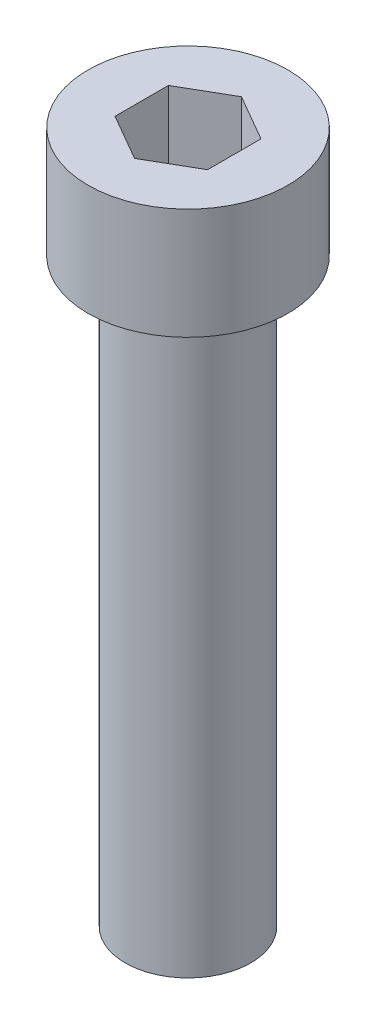
ISO-10303-21;
HEADER;
FILE_DESCRIPTION(('STEP AP214'),'2;1');
FILE_NAME('part.step','',(''),(''),'','','');
FILE_SCHEMA(('AUTOMOTIVE_DESIGN { 1 0 10303 214 1 1 1 1 }'));
ENDSEC;
DATA;
#1=APPLICATION_CONTEXT('core data for automotive mechanical design processes');
#2=APPLICATION_PROTOCOL_DEFINITION('international standard','automotive_design',2000,#1);
#3=PRODUCT_CONTEXT('',#1,'mechanical');
#4=PRODUCT('Part','Part','',(#3));
#5=PRODUCT_RELATED_PRODUCT_CATEGORY('part','',(#4));
#6=PRODUCT_DEFINITION_FORMATION('','',#4);
#7=PRODUCT_DEFINITION_CONTEXT('part definition',#1,'design');
#8=PRODUCT_DEFINITION('design','',#6,#7);
#9=PRODUCT_DEFINITION_SHAPE('','',#8);
#10=(LENGTH_UNIT() NAMED_UNIT(*) SI_UNIT(.MILLI.,.METRE.));
#11=(NAMED_UNIT(*) PLANE_ANGLE_UNIT() SI_UNIT($,.RADIAN.));
#12=(NAMED_UNIT(*) SI_UNIT($,.STERADIAN.) SOLID_ANGLE_UNIT());
#13=UNCERTAINTY_MEASURE_WITH_UNIT(LENGTH_MEASURE(1.E-05),#10,'distance_accuracy_value','');
#14=(GEOMETRIC_REPRESENTATION_CONTEXT(3) GLOBAL_UNCERTAINTY_ASSIGNED_CONTEXT((#13)) GLOBAL_UNIT_ASSIGNED_CONTEXT((#10,
#11,#12)) REPRESENTATION_CONTEXT('',''));
#15=CARTESIAN_POINT('',(0.,0.,0.));
#16=DIRECTION('',(0.,0.,1.));
#17=DIRECTION('',(1.,0.,0.));
#18=AXIS2_PLACEMENT_3D('',#15,#16,#17);
#19=CARTESIAN_POINT('',(184.714490271524,-3.,125.244295140347));
#20=DIRECTION('',(0.,1.,0.));
#21=DIRECTION('',(0.,0.,1.));
#22=AXIS2_PLACEMENT_3D('',#19,#20,#21);
#23=CYLINDRICAL_SURFACE('',#22,2.70000000000001);
#24=CARTESIAN_POINT('',(184.714490271524,-3.,125.244295140347));
#25=DIRECTION('',(0.,1.,0.));
#26=DIRECTION('',(0.,0.,1.));
#27=AXIS2_PLACEMENT_3D('',#24,#25,#26);
#28=CIRCLE('',#27,2.70000000000001);
#29=CARTESIAN_POINT('',(184.714490271524,-3.,127.944295140347));
#30=VERTEX_POINT('',#29);
#31=EDGE_CURVE('E48',#30,#30,#28,.T.);
#32=ORIENTED_EDGE('',*,*,#31,.T.);
#33=EDGE_LOOP('',(#32));
#34=FACE_BOUND('',#33,.T.);
#35=CARTESIAN_POINT('',(184.714490271524,0.,125.244295140347));
#36=DIRECTION('',(0.,1.,0.));
#37=DIRECTION('',(0.,0.,1.));
#38=AXIS2_PLACEMENT_3D('',#35,#36,#37);
#39=CIRCLE('',#38,2.70000000000001);
#40=CARTESIAN_POINT('',(184.714490271524,0.,127.944295140347));
#41=VERTEX_POINT('',#40);
#42=EDGE_CURVE('E42',#41,#41,#39,.T.);
#43=ORIENTED_EDGE('',*,*,#42,.F.);
#44=EDGE_LOOP('',(#43));
#45=FACE_BOUND('',#44,.T.);
#46=ADVANCED_FACE('F39',(#34,#45),#23,.T.);
#47=CARTESIAN_POINT('',(184.714490271524,-3.,125.244295140347));
#48=DIRECTION('',(0.,1.,0.));
#49=DIRECTION('',(0.,0.,1.));
#50=AXIS2_PLACEMENT_3D('',#47,#48,#49);
#51=PLANE('',#50);
#52=CARTESIAN_POINT('',(184.714490271524,-3.,125.244295140347));
#53=DIRECTION('',(0.,-1.,0.));
#54=DIRECTION('',(0.,0.,-1.));
#55=AXIS2_PLACEMENT_3D('',#52,#53,#54);
#56=CIRCLE('',#55,1.69629374220996);
#57=CARTESIAN_POINT('',(184.714490271524,-3.,123.548001398137));
#58=VERTEX_POINT('',#57);
#59=EDGE_CURVE('E11',#58,#58,#56,.T.);
#60=ORIENTED_EDGE('',*,*,#59,.F.);
#61=EDGE_LOOP('',(#60));
#62=FACE_BOUND('',#61,.T.);
#63=ORIENTED_EDGE('',*,*,#31,.F.);
#64=EDGE_LOOP('',(#63));
#65=FACE_BOUND('',#64,.T.);
#66=ADVANCED_FACE('F178',(#62,#65),#51,.F.);
#67=CARTESIAN_POINT('',(184.714490271524,0.,125.244295140347));
#68=DIRECTION('',(0.,1.,0.));
#69=DIRECTION('',(0.,0.,1.));
#70=AXIS2_PLACEMENT_3D('',#67,#68,#69);
#71=PLANE('',#70);
#72=DIRECTION('',(-0.866025403784435,0.,-0.500000000000006));
#73=VECTOR('',#72,1.);
#74=CARTESIAN_POINT('',(185.964490271524,0.,124.52260730386));
#75=LINE('',#74,#73);
#76=CARTESIAN_POINT('',(185.964490271524,0.,124.52260730386));
#77=VERTEX_POINT('',#76);
#78=CARTESIAN_POINT('',(184.714490271524,0.,123.800919467373));
#79=VERTEX_POINT('',#78);
#80=EDGE_CURVE('E56',#77,#79,#75,.T.);
#81=ORIENTED_EDGE('',*,*,#80,.F.);
#82=DIRECTION('',(0.,0.,-1.));
#83=VECTOR('',#82,1.);
#84=CARTESIAN_POINT('',(185.964490271524,0.,125.965982976834));
#85=LINE('',#84,#83);
#86=CARTESIAN_POINT('',(185.964490271524,0.,125.965982976834));
#87=VERTEX_POINT('',#86);
#88=EDGE_CURVE('E149',#87,#77,#85,.T.);
#89=ORIENTED_EDGE('',*,*,#88,.F.);
#90=DIRECTION('',(0.86602540378443,0.,-0.500000000000015));
#91=VECTOR('',#90,1.);
#92=CARTESIAN_POINT('',(184.714490271524,0.,126.687670813321));
#93=LINE('',#92,#91);
#94=CARTESIAN_POINT('',(184.714490271524,0.,126.687670813321));
#95=VERTEX_POINT('',#94);
#96=EDGE_CURVE('E146',#95,#87,#93,.T.);
#97=ORIENTED_EDGE('',*,*,#96,.F.);
#98=DIRECTION('',(0.866025403784436,0.,0.500000000000004));
#99=VECTOR('',#98,1.);
#100=CARTESIAN_POINT('',(183.464490271524,0.,125.965982976834));
#101=LINE('',#100,#99);
#102=CARTESIAN_POINT('',(183.464490271524,0.,125.965982976834));
#103=VERTEX_POINT('',#102);
#104=EDGE_CURVE('E104',#103,#95,#101,.T.);
#105=ORIENTED_EDGE('',*,*,#104,.F.);
#106=DIRECTION('',(0.,0.,1.));
#107=VECTOR('',#106,1.);
#108=CARTESIAN_POINT('',(183.464490271524,0.,124.52260730386));
#109=LINE('',#108,#107);
#110=CARTESIAN_POINT('',(183.464490271524,0.,124.52260730386));
#111=VERTEX_POINT('',#110);
#112=EDGE_CURVE('E140',#111,#103,#109,.T.);
#113=ORIENTED_EDGE('',*,*,#112,.F.);
#114=DIRECTION('',(-0.86602540378444,0.,0.499999999999998));
#115=VECTOR('',#114,1.);
#116=CARTESIAN_POINT('',(184.714490271524,0.,123.800919467373));
#117=LINE('',#116,#115);
#118=EDGE_CURVE('E136',#79,#111,#117,.T.);
#119=ORIENTED_EDGE('',*,*,#118,.F.);
#120=EDGE_LOOP('',(#81,#89,#97,#105,#113,#119));
#121=FACE_BOUND('',#120,.T.);
#122=ORIENTED_EDGE('',*,*,#42,.T.);
#123=EDGE_LOOP('',(#122));
#124=FACE_BOUND('',#123,.T.);
#125=ADVANCED_FACE('F175',(#121,#124),#71,.T.);
#126=CARTESIAN_POINT('',(184.714490271524,-18.7,125.244295140347));
#127=DIRECTION('',(0.,1.,0.));
#128=DIRECTION('',(0.,0.,1.));
#129=AXIS2_PLACEMENT_3D('',#126,#127,#128);
#130=CYLINDRICAL_SURFACE('',#129,1.69629374220996);
#131=CARTESIAN_POINT('',(184.714490271524,-18.7,125.244295140347));
#132=DIRECTION('',(0.,-1.,0.));
#133=DIRECTION('',(0.,0.,-1.));
#134=AXIS2_PLACEMENT_3D('',#131,#132,#133);
#135=CIRCLE('',#134,1.69629374220996);
#136=CARTESIAN_POINT('',(184.714490271524,-18.7,123.548001398137));
#137=VERTEX_POINT('',#136);
#138=EDGE_CURVE('E155',#137,#137,#135,.T.);
#139=ORIENTED_EDGE('',*,*,#138,.F.);
#140=EDGE_LOOP('',(#139));
#141=FACE_BOUND('',#140,.T.);
#142=ORIENTED_EDGE('',*,*,#59,.T.);
#143=EDGE_LOOP('',(#142));
#144=FACE_BOUND('',#143,.T.);
#145=ADVANCED_FACE('F187',(#141,#144),#130,.T.);
#146=CARTESIAN_POINT('',(184.714490271524,-18.7,125.244295140347));
#147=DIRECTION('',(0.,-1.,0.));
#148=DIRECTION('',(0.,0.,-1.));
#149=AXIS2_PLACEMENT_3D('',#146,#147,#148);
#150=PLANE('',#149);
#151=ORIENTED_EDGE('',*,*,#138,.T.);
#152=EDGE_LOOP('',(#151));
#153=FACE_BOUND('',#152,.T.);
#154=ADVANCED_FACE('F194',(#153),#150,.T.);
#155=CARTESIAN_POINT('',(185.964490271524,-2.,124.52260730386));
#156=DIRECTION('',(0.500000000000006,0.,-0.866025403784435));
#157=DIRECTION('',(-0.866025403784435,0.,-0.500000000000006));
#158=AXIS2_PLACEMENT_3D('',#155,#156,#157);
#159=PLANE('',#158);
#160=ORIENTED_EDGE('',*,*,#80,.T.);
#161=DIRECTION('',(0.,1.,0.));
#162=VECTOR('',#161,1.);
#163=CARTESIAN_POINT('',(184.714490271524,-2.,123.800919467373));
#164=LINE('',#163,#162);
#165=CARTESIAN_POINT('',(184.714490271524,-2.,123.800919467373));
#166=VERTEX_POINT('',#165);
#167=EDGE_CURVE('E86',#166,#79,#164,.T.);
#168=ORIENTED_EDGE('',*,*,#167,.F.);
#169=DIRECTION('',(-0.866025403784435,0.,-0.500000000000006));
#170=VECTOR('',#169,1.);
#171=CARTESIAN_POINT('',(185.964490271524,-2.,124.52260730386));
#172=LINE('',#171,#170);
#173=CARTESIAN_POINT('',(185.964490271524,-2.,124.52260730386));
#174=VERTEX_POINT('',#173);
#175=EDGE_CURVE('E152',#174,#166,#172,.T.);
#176=ORIENTED_EDGE('',*,*,#175,.F.);
#177=DIRECTION('',(0.,1.,0.));
#178=VECTOR('',#177,1.);
#179=CARTESIAN_POINT('',(185.964490271524,-2.,124.52260730386));
#180=LINE('',#179,#178);
#181=EDGE_CURVE('E64',#174,#77,#180,.T.);
#182=ORIENTED_EDGE('',*,*,#181,.T.);
#183=EDGE_LOOP('',(#160,#168,#176,#182));
#184=FACE_BOUND('',#183,.T.);
#185=ADVANCED_FACE('F198',(#184),#159,.F.);
#186=CARTESIAN_POINT('',(185.964490271524,-2.,125.965982976834));
#187=DIRECTION('',(1.,0.,0.));
#188=DIRECTION('',(0.,0.,-1.));
#189=AXIS2_PLACEMENT_3D('',#186,#187,#188);
#190=PLANE('',#189);
#191=ORIENTED_EDGE('',*,*,#88,.T.);
#192=ORIENTED_EDGE('',*,*,#181,.F.);
#193=DIRECTION('',(0.,0.,-1.));
#194=VECTOR('',#193,1.);
#195=CARTESIAN_POINT('',(185.964490271524,-2.,125.965982976834));
#196=LINE('',#195,#194);
#197=CARTESIAN_POINT('',(185.964490271524,-2.,125.965982976834));
#198=VERTEX_POINT('',#197);
#199=EDGE_CURVE('E118',#198,#174,#196,.T.);
#200=ORIENTED_EDGE('',*,*,#199,.F.);
#201=DIRECTION('',(0.,1.,0.));
#202=VECTOR('',#201,1.);
#203=CARTESIAN_POINT('',(185.964490271524,-2.,125.965982976834));
#204=LINE('',#203,#202);
#205=EDGE_CURVE('E109',#198,#87,#204,.T.);
#206=ORIENTED_EDGE('',*,*,#205,.T.);
#207=EDGE_LOOP('',(#191,#192,#200,#206));
#208=FACE_BOUND('',#207,.T.);
#209=ADVANCED_FACE('F202',(#208),#190,.F.);
#210=CARTESIAN_POINT('',(184.714490271524,-2.,126.687670813321));
#211=DIRECTION('',(0.500000000000015,0.,0.86602540378443));
#212=DIRECTION('',(0.86602540378443,0.,-0.500000000000015));
#213=AXIS2_PLACEMENT_3D('',#210,#211,#212);
#214=PLANE('',#213);
#215=ORIENTED_EDGE('',*,*,#96,.T.);
#216=ORIENTED_EDGE('',*,*,#205,.F.);
#217=DIRECTION('',(0.86602540378443,0.,-0.500000000000015));
#218=VECTOR('',#217,1.);
#219=CARTESIAN_POINT('',(184.714490271524,-2.,126.687670813321));
#220=LINE('',#219,#218);
#221=CARTESIAN_POINT('',(184.714490271524,-2.,126.687670813321));
#222=VERTEX_POINT('',#221);
#223=EDGE_CURVE('E113',#222,#198,#220,.T.);
#224=ORIENTED_EDGE('',*,*,#223,.F.);
#225=DIRECTION('',(0.,1.,0.));
#226=VECTOR('',#225,1.);
#227=CARTESIAN_POINT('',(184.714490271524,-2.,126.687670813321));
#228=LINE('',#227,#226);
#229=EDGE_CURVE('E97',#222,#95,#228,.T.);
#230=ORIENTED_EDGE('',*,*,#229,.T.);
#231=EDGE_LOOP('',(#215,#216,#224,#230));
#232=FACE_BOUND('',#231,.T.);
#233=ADVANCED_FACE('F114',(#232),#214,.F.);
#234=CARTESIAN_POINT('',(183.464490271524,-2.,125.965982976834));
#235=DIRECTION('',(-0.500000000000004,0.,0.866025403784436));
#236=DIRECTION('',(0.866025403784436,0.,0.500000000000004));
#237=AXIS2_PLACEMENT_3D('',#234,#235,#236);
#238=PLANE('',#237);
#239=ORIENTED_EDGE('',*,*,#104,.T.);
#240=ORIENTED_EDGE('',*,*,#229,.F.);
#241=DIRECTION('',(0.866025403784436,0.,0.500000000000004));
#242=VECTOR('',#241,1.);
#243=CARTESIAN_POINT('',(183.464490271524,-2.,125.965982976834));
#244=LINE('',#243,#242);
#245=CARTESIAN_POINT('',(183.464490271524,-2.,125.965982976834));
#246=VERTEX_POINT('',#245);
#247=EDGE_CURVE('E101',#246,#222,#244,.T.);
#248=ORIENTED_EDGE('',*,*,#247,.F.);
#249=DIRECTION('',(0.,1.,0.));
#250=VECTOR('',#249,1.);
#251=CARTESIAN_POINT('',(183.464490271524,-2.,125.965982976834));
#252=LINE('',#251,#250);
#253=EDGE_CURVE('E110',#246,#103,#252,.T.);
#254=ORIENTED_EDGE('',*,*,#253,.T.);
#255=EDGE_LOOP('',(#239,#240,#248,#254));
#256=FACE_BOUND('',#255,.T.);
#257=ADVANCED_FACE('F99',(#256),#238,.F.);
#258=CARTESIAN_POINT('',(183.464490271524,-2.,124.52260730386));
#259=DIRECTION('',(-1.,0.,0.));
#260=DIRECTION('',(0.,0.,1.));
#261=AXIS2_PLACEMENT_3D('',#258,#259,#260);
#262=PLANE('',#261);
#263=ORIENTED_EDGE('',*,*,#112,.T.);
#264=ORIENTED_EDGE('',*,*,#253,.F.);
#265=DIRECTION('',(0.,0.,1.));
#266=VECTOR('',#265,1.);
#267=CARTESIAN_POINT('',(183.464490271524,-2.,124.52260730386));
#268=LINE('',#267,#266);
#269=CARTESIAN_POINT('',(183.464490271524,-2.,124.52260730386));
#270=VERTEX_POINT('',#269);
#271=EDGE_CURVE('E124',#270,#246,#268,.T.);
#272=ORIENTED_EDGE('',*,*,#271,.F.);
#273=DIRECTION('',(0.,1.,0.));
#274=VECTOR('',#273,1.);
#275=CARTESIAN_POINT('',(183.464490271524,-2.,124.52260730386));
#276=LINE('',#275,#274);
#277=EDGE_CURVE('E160',#270,#111,#276,.T.);
#278=ORIENTED_EDGE('',*,*,#277,.T.);
#279=EDGE_LOOP('',(#263,#264,#272,#278));
#280=FACE_BOUND('',#279,.T.);
#281=ADVANCED_FACE('F206',(#280),#262,.F.);
#282=CARTESIAN_POINT('',(184.714490271524,-2.,123.800919467373));
#283=DIRECTION('',(-0.499999999999998,0.,-0.86602540378444));
#284=DIRECTION('',(-0.86602540378444,0.,0.499999999999998));
#285=AXIS2_PLACEMENT_3D('',#282,#283,#284);
#286=PLANE('',#285);
#287=ORIENTED_EDGE('',*,*,#118,.T.);
#288=ORIENTED_EDGE('',*,*,#277,.F.);
#289=DIRECTION('',(-0.86602540378444,0.,0.499999999999998));
#290=VECTOR('',#289,1.);
#291=CARTESIAN_POINT('',(184.714490271524,-2.,123.800919467373));
#292=LINE('',#291,#290);
#293=EDGE_CURVE('E128',#166,#270,#292,.T.);
#294=ORIENTED_EDGE('',*,*,#293,.F.);
#295=ORIENTED_EDGE('',*,*,#167,.T.);
#296=EDGE_LOOP('',(#287,#288,#294,#295));
#297=FACE_BOUND('',#296,.T.);
#298=ADVANCED_FACE('F203',(#297),#286,.F.);
#299=CARTESIAN_POINT('',(0.,-2.,0.));
#300=DIRECTION('',(0.,1.,0.));
#301=DIRECTION('',(0.,0.,1.));
#302=AXIS2_PLACEMENT_3D('',#299,#300,#301);
#303=PLANE('',#302);
#304=ORIENTED_EDGE('',*,*,#175,.T.);
#305=ORIENTED_EDGE('',*,*,#293,.T.);
#306=ORIENTED_EDGE('',*,*,#271,.T.);
#307=ORIENTED_EDGE('',*,*,#247,.T.);
#308=ORIENTED_EDGE('',*,*,#223,.T.);
#309=ORIENTED_EDGE('',*,*,#199,.T.);
#310=EDGE_LOOP('',(#304,#305,#306,#307,#308,#309));
#311=FACE_BOUND('',#310,.T.);
#312=ADVANCED_FACE('F121',(#311),#303,.T.);
#313=CLOSED_SHELL('',(#46,#66,#125,#145,#154,#185,#209,#233,#257,#281,#298,#312));
#314=MANIFOLD_SOLID_BREP('B2',#313);
#315=ADVANCED_BREP_SHAPE_REPRESENTATION('',(#18,#314),#14);
#316=SHAPE_DEFINITION_REPRESENTATION(#9,#315);
ENDSEC;
END-ISO-10303-21;
